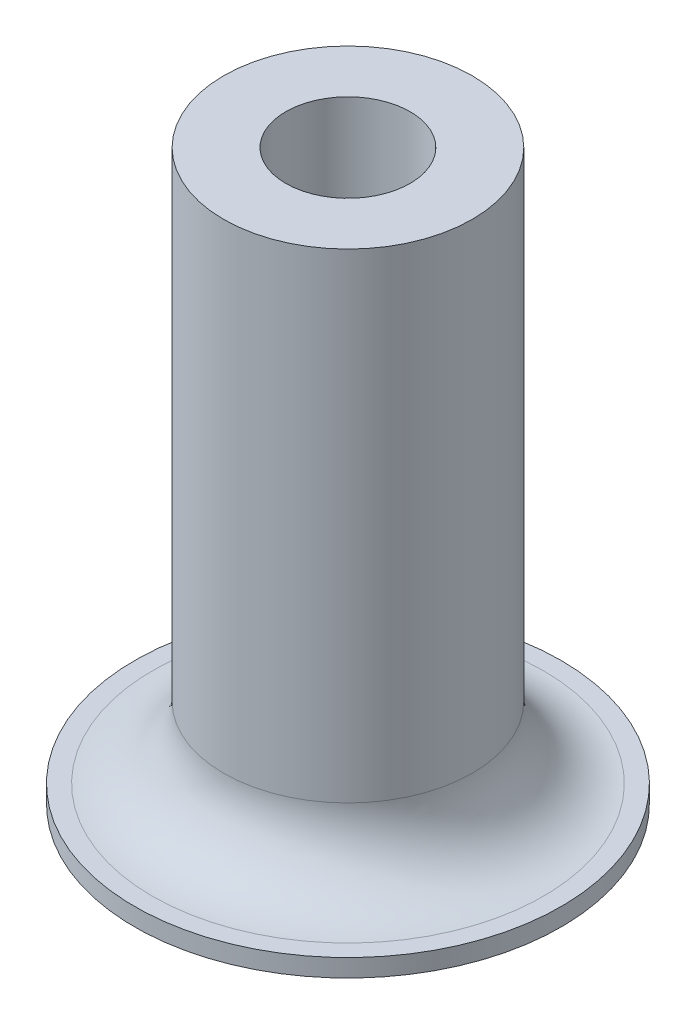
ISO-10303-21;
HEADER;
FILE_DESCRIPTION(('STEP AP214'),'2;1');
FILE_NAME('part.step','',(''),(''),'','','');
FILE_SCHEMA(('AUTOMOTIVE_DESIGN { 1 0 10303 214 1 1 1 1 }'));
ENDSEC;
DATA;
#1=APPLICATION_CONTEXT('core data for automotive mechanical design processes');
#2=APPLICATION_PROTOCOL_DEFINITION('international standard','automotive_design',2000,#1);
#3=PRODUCT_CONTEXT('',#1,'mechanical');
#4=PRODUCT('Part','Part','',(#3));
#5=PRODUCT_RELATED_PRODUCT_CATEGORY('part','',(#4));
#6=PRODUCT_DEFINITION_FORMATION('','',#4);
#7=PRODUCT_DEFINITION_CONTEXT('part definition',#1,'design');
#8=PRODUCT_DEFINITION('design','',#6,#7);
#9=PRODUCT_DEFINITION_SHAPE('','',#8);
#10=(LENGTH_UNIT() NAMED_UNIT(*) SI_UNIT(.MILLI.,.METRE.));
#11=(NAMED_UNIT(*) PLANE_ANGLE_UNIT() SI_UNIT($,.RADIAN.));
#12=(NAMED_UNIT(*) SI_UNIT($,.STERADIAN.) SOLID_ANGLE_UNIT());
#13=UNCERTAINTY_MEASURE_WITH_UNIT(LENGTH_MEASURE(1.E-05),#10,'distance_accuracy_value','');
#14=(GEOMETRIC_REPRESENTATION_CONTEXT(3) GLOBAL_UNCERTAINTY_ASSIGNED_CONTEXT((#13)) GLOBAL_UNIT_ASSIGNED_CONTEXT((#10,
#11,#12)) REPRESENTATION_CONTEXT('',''));
#15=CARTESIAN_POINT('',(0.,0.,0.));
#16=DIRECTION('',(0.,0.,1.));
#17=DIRECTION('',(1.,0.,0.));
#18=AXIS2_PLACEMENT_3D('',#15,#16,#17);
#19=CARTESIAN_POINT('',(0.,32.,0.));
#20=DIRECTION('',(0.,-1.,0.));
#21=DIRECTION('',(0.,0.,-1.));
#22=AXIS2_PLACEMENT_3D('',#19,#20,#21);
#23=CYLINDRICAL_SURFACE('',#22,7.);
#24=CARTESIAN_POINT('',(0.,5.,0.));
#25=DIRECTION('',(0.,-1.,0.));
#26=DIRECTION('',(0.,0.,-1.));
#27=AXIS2_PLACEMENT_3D('',#24,#25,#26);
#28=CIRCLE('',#27,7.);
#29=CARTESIAN_POINT('',(0.,5.,-7.));
#30=VERTEX_POINT('',#29);
#31=EDGE_CURVE('E10',#30,#30,#28,.F.);
#32=ORIENTED_EDGE('',*,*,#31,.T.);
#33=EDGE_LOOP('',(#32));
#34=FACE_BOUND('',#33,.T.);
#35=CARTESIAN_POINT('',(0.,32.,0.));
#36=DIRECTION('',(0.,1.,0.));
#37=DIRECTION('',(0.,0.,1.));
#38=AXIS2_PLACEMENT_3D('',#35,#36,#37);
#39=CIRCLE('',#38,7.);
#40=CARTESIAN_POINT('',(0.,32.,7.));
#41=VERTEX_POINT('',#40);
#42=EDGE_CURVE('E42',#41,#41,#39,.T.);
#43=ORIENTED_EDGE('',*,*,#42,.F.);
#44=EDGE_LOOP('',(#43));
#45=FACE_BOUND('',#44,.T.);
#46=ADVANCED_FACE('F31',(#34,#45),#23,.T.);
#47=CARTESIAN_POINT('',(0.,32.,0.));
#48=DIRECTION('',(0.,-1.,0.));
#49=DIRECTION('',(0.,0.,-1.));
#50=AXIS2_PLACEMENT_3D('',#47,#48,#49);
#51=CYLINDRICAL_SURFACE('',#50,3.5);
#52=CARTESIAN_POINT('',(0.,32.,0.));
#53=DIRECTION('',(0.,1.,0.));
#54=DIRECTION('',(0.,0.,1.));
#55=AXIS2_PLACEMENT_3D('',#52,#53,#54);
#56=CIRCLE('',#55,3.5);
#57=CARTESIAN_POINT('',(0.,32.,3.5));
#58=VERTEX_POINT('',#57);
#59=EDGE_CURVE('E46',#58,#58,#56,.T.);
#60=ORIENTED_EDGE('',*,*,#59,.T.);
#61=EDGE_LOOP('',(#60));
#62=FACE_BOUND('',#61,.T.);
#63=CARTESIAN_POINT('',(0.,0.,0.));
#64=DIRECTION('',(0.,1.,0.));
#65=DIRECTION('',(0.,0.,1.));
#66=AXIS2_PLACEMENT_3D('',#63,#64,#65);
#67=CIRCLE('',#66,3.5);
#68=CARTESIAN_POINT('',(0.,0.,3.5));
#69=VERTEX_POINT('',#68);
#70=EDGE_CURVE('E49',#69,#69,#67,.T.);
#71=ORIENTED_EDGE('',*,*,#70,.F.);
#72=EDGE_LOOP('',(#71));
#73=FACE_BOUND('',#72,.T.);
#74=ADVANCED_FACE('F75',(#62,#73),#51,.F.);
#75=CARTESIAN_POINT('',(0.,32.,0.));
#76=DIRECTION('',(0.,1.,0.));
#77=DIRECTION('',(0.,0.,1.));
#78=AXIS2_PLACEMENT_3D('',#75,#76,#77);
#79=PLANE('',#78);
#80=ORIENTED_EDGE('',*,*,#59,.F.);
#81=EDGE_LOOP('',(#80));
#82=FACE_BOUND('',#81,.T.);
#83=ORIENTED_EDGE('',*,*,#42,.T.);
#84=EDGE_LOOP('',(#83));
#85=FACE_BOUND('',#84,.T.);
#86=ADVANCED_FACE('F80',(#82,#85),#79,.T.);
#87=CARTESIAN_POINT('',(0.,0.,0.));
#88=DIRECTION('',(0.,1.,0.));
#89=DIRECTION('',(0.,0.,1.));
#90=AXIS2_PLACEMENT_3D('',#87,#88,#89);
#91=PLANE('',#90);
#92=ORIENTED_EDGE('',*,*,#70,.T.);
#93=EDGE_LOOP('',(#92));
#94=FACE_BOUND('',#93,.T.);
#95=CARTESIAN_POINT('',(0.,0.,0.));
#96=DIRECTION('',(0.,-1.,0.));
#97=DIRECTION('',(0.,0.,-1.));
#98=AXIS2_PLACEMENT_3D('',#95,#96,#97);
#99=CIRCLE('',#98,12.);
#100=CARTESIAN_POINT('',(0.,0.,-12.));
#101=VERTEX_POINT('',#100);
#102=EDGE_CURVE('E55',#101,#101,#99,.T.);
#103=ORIENTED_EDGE('',*,*,#102,.T.);
#104=EDGE_LOOP('',(#103));
#105=FACE_BOUND('',#104,.T.);
#106=ADVANCED_FACE('F72',(#94,#105),#91,.F.);
#107=CARTESIAN_POINT('',(0.,1.,0.));
#108=DIRECTION('',(0.,-1.,0.));
#109=DIRECTION('',(0.,0.,-1.));
#110=AXIS2_PLACEMENT_3D('',#107,#108,#109);
#111=CYLINDRICAL_SURFACE('',#110,12.);
#112=CARTESIAN_POINT('',(0.,1.,0.));
#113=DIRECTION('',(0.,-1.,0.));
#114=DIRECTION('',(0.,0.,-1.));
#115=AXIS2_PLACEMENT_3D('',#112,#113,#114);
#116=CIRCLE('',#115,12.);
#117=CARTESIAN_POINT('',(0.,1.,-12.));
#118=VERTEX_POINT('',#117);
#119=EDGE_CURVE('E51',#118,#118,#116,.T.);
#120=ORIENTED_EDGE('',*,*,#119,.T.);
#121=EDGE_LOOP('',(#120));
#122=FACE_BOUND('',#121,.T.);
#123=ORIENTED_EDGE('',*,*,#102,.F.);
#124=EDGE_LOOP('',(#123));
#125=FACE_BOUND('',#124,.T.);
#126=ADVANCED_FACE('F61',(#122,#125),#111,.T.);
#127=CARTESIAN_POINT('',(0.,1.,0.));
#128=DIRECTION('',(0.,-1.,0.));
#129=DIRECTION('',(0.,0.,-1.));
#130=AXIS2_PLACEMENT_3D('',#127,#128,#129);
#131=PLANE('',#130);
#132=CARTESIAN_POINT('',(0.,1.,0.));
#133=DIRECTION('',(0.,-1.,0.));
#134=DIRECTION('',(0.,0.,-1.));
#135=AXIS2_PLACEMENT_3D('',#132,#133,#134);
#136=CIRCLE('',#135,11.);
#137=CARTESIAN_POINT('',(0.,1.,-11.));
#138=VERTEX_POINT('',#137);
#139=EDGE_CURVE('E38',#138,#138,#136,.T.);
#140=ORIENTED_EDGE('',*,*,#139,.T.);
#141=EDGE_LOOP('',(#140));
#142=FACE_BOUND('',#141,.T.);
#143=ORIENTED_EDGE('',*,*,#119,.F.);
#144=EDGE_LOOP('',(#143));
#145=FACE_BOUND('',#144,.T.);
#146=ADVANCED_FACE('F64',(#142,#145),#131,.F.);
#147=CARTESIAN_POINT('',(0.,5.,0.));
#148=DIRECTION('',(0.,-1.,0.));
#149=DIRECTION('',(0.,0.,-1.));
#150=AXIS2_PLACEMENT_3D('',#147,#148,#149);
#151=TOROIDAL_SURFACE('',#150,11.,4.);
#152=ORIENTED_EDGE('',*,*,#31,.F.);
#153=EDGE_LOOP('',(#152));
#154=FACE_BOUND('',#153,.T.);
#155=ORIENTED_EDGE('',*,*,#139,.F.);
#156=EDGE_LOOP('',(#155));
#157=FACE_BOUND('',#156,.T.);
#158=ADVANCED_FACE('F33',(#154,#157),#151,.F.);
#159=CLOSED_SHELL('',(#46,#74,#86,#106,#126,#146,#158));
#160=MANIFOLD_SOLID_BREP('B2',#159);
#161=ADVANCED_BREP_SHAPE_REPRESENTATION('',(#18,#160),#14);
#162=SHAPE_DEFINITION_REPRESENTATION(#9,#161);
ENDSEC;
END-ISO-10303-21;
